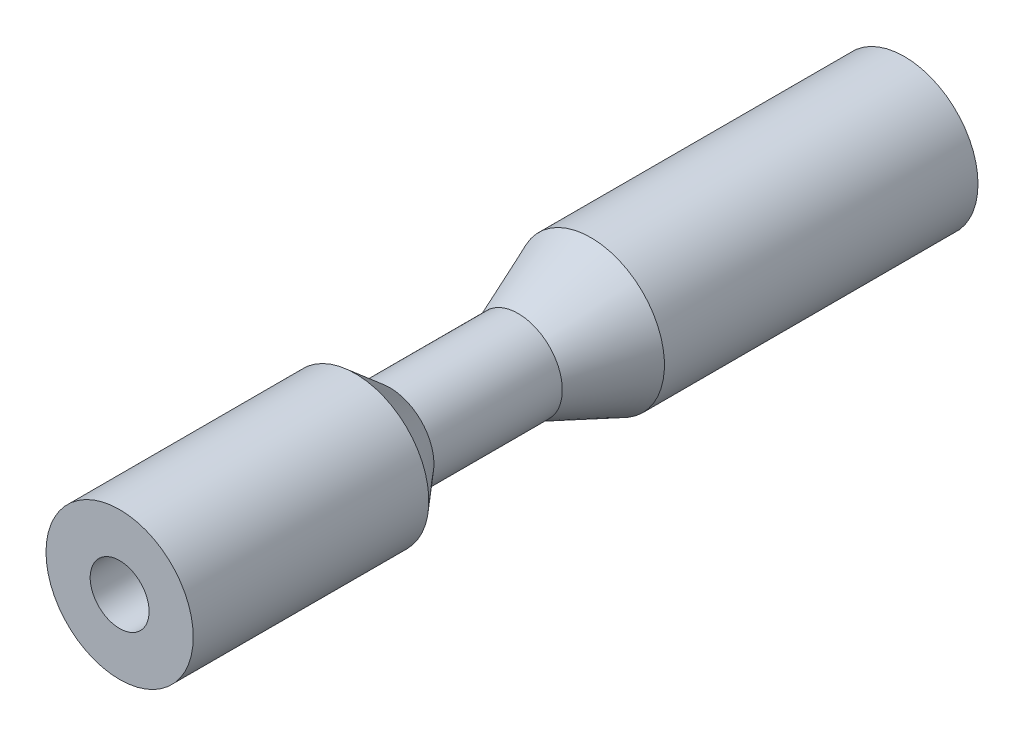
ISO-10303-21;
HEADER;
FILE_DESCRIPTION(('STEP AP214'),'2;1');
FILE_NAME('part.step','',(''),(''),'','','');
FILE_SCHEMA(('AUTOMOTIVE_DESIGN { 1 0 10303 214 1 1 1 1 }'));
ENDSEC;
DATA;
#1=APPLICATION_CONTEXT('core data for automotive mechanical design processes');
#2=APPLICATION_PROTOCOL_DEFINITION('international standard','automotive_design',2000,#1);
#3=PRODUCT_CONTEXT('',#1,'mechanical');
#4=PRODUCT('Part','Part','',(#3));
#5=PRODUCT_RELATED_PRODUCT_CATEGORY('part','',(#4));
#6=PRODUCT_DEFINITION_FORMATION('','',#4);
#7=PRODUCT_DEFINITION_CONTEXT('part definition',#1,'design');
#8=PRODUCT_DEFINITION('design','',#6,#7);
#9=PRODUCT_DEFINITION_SHAPE('','',#8);
#10=(LENGTH_UNIT() NAMED_UNIT(*) SI_UNIT(.MILLI.,.METRE.));
#11=(NAMED_UNIT(*) PLANE_ANGLE_UNIT() SI_UNIT($,.RADIAN.));
#12=(NAMED_UNIT(*) SI_UNIT($,.STERADIAN.) SOLID_ANGLE_UNIT());
#13=UNCERTAINTY_MEASURE_WITH_UNIT(LENGTH_MEASURE(1.E-05),#10,'distance_accuracy_value','');
#14=(GEOMETRIC_REPRESENTATION_CONTEXT(3) GLOBAL_UNCERTAINTY_ASSIGNED_CONTEXT((#13)) GLOBAL_UNIT_ASSIGNED_CONTEXT((#10,
#11,#12)) REPRESENTATION_CONTEXT('',''));
#15=CARTESIAN_POINT('',(0.,0.,0.));
#16=DIRECTION('',(0.,0.,1.));
#17=DIRECTION('',(1.,0.,0.));
#18=AXIS2_PLACEMENT_3D('',#15,#16,#17);
#19=CARTESIAN_POINT('',(0.,0.,27.));
#20=DIRECTION('',(0.,0.,-1.));
#21=DIRECTION('',(-1.,0.,0.));
#22=AXIS2_PLACEMENT_3D('',#19,#20,#21);
#23=CYLINDRICAL_SURFACE('',#22,2.5);
#24=CARTESIAN_POINT('',(0.,0.,27.));
#25=DIRECTION('',(0.,0.,1.));
#26=DIRECTION('',(1.,0.,0.));
#27=AXIS2_PLACEMENT_3D('',#24,#25,#26);
#28=CIRCLE('',#27,2.5);
#29=CARTESIAN_POINT('',(2.5,0.,27.));
#30=VERTEX_POINT('',#29);
#31=EDGE_CURVE('E40',#30,#30,#28,.T.);
#32=ORIENTED_EDGE('',*,*,#31,.F.);
#33=EDGE_LOOP('',(#32));
#34=FACE_BOUND('',#33,.T.);
#35=CARTESIAN_POINT('',(0.,0.,19.));
#36=DIRECTION('',(0.,0.,-1.));
#37=DIRECTION('',(-1.,0.,0.));
#38=AXIS2_PLACEMENT_3D('',#35,#36,#37);
#39=CIRCLE('',#38,2.5);
#40=CARTESIAN_POINT('',(-2.5,0.,19.));
#41=VERTEX_POINT('',#40);
#42=EDGE_CURVE('E44',#41,#41,#39,.T.);
#43=ORIENTED_EDGE('',*,*,#42,.F.);
#44=EDGE_LOOP('',(#43));
#45=FACE_BOUND('',#44,.T.);
#46=ADVANCED_FACE('F29',(#34,#45),#23,.T.);
#47=CARTESIAN_POINT('',(0.,0.,27.));
#48=DIRECTION('',(0.,0.,1.));
#49=DIRECTION('',(1.,0.,0.));
#50=AXIS2_PLACEMENT_3D('',#47,#48,#49);
#51=PLANE('',#50);
#52=CARTESIAN_POINT('',(0.,0.,27.));
#53=DIRECTION('',(0.,0.,1.));
#54=DIRECTION('',(1.,0.,0.));
#55=AXIS2_PLACEMENT_3D('',#52,#53,#54);
#56=CIRCLE('',#55,0.999999999999998);
#57=CARTESIAN_POINT('',(0.999999999999998,0.,27.));
#58=VERTEX_POINT('',#57);
#59=EDGE_CURVE('E61',#58,#58,#56,.T.);
#60=ORIENTED_EDGE('',*,*,#59,.F.);
#61=EDGE_LOOP('',(#60));
#62=FACE_BOUND('',#61,.T.);
#63=ORIENTED_EDGE('',*,*,#31,.T.);
#64=EDGE_LOOP('',(#63));
#65=FACE_BOUND('',#64,.T.);
#66=ADVANCED_FACE('F88',(#62,#65),#51,.T.);
#67=CARTESIAN_POINT('',(0.,0.,17.8276762664459));
#68=DIRECTION('',(0.,0.,1.));
#69=DIRECTION('',(1.,0.,0.));
#70=AXIS2_PLACEMENT_3D('',#67,#68,#69);
#71=CONICAL_SURFACE('',#70,1.5,0.706237021045399);
#72=ORIENTED_EDGE('',*,*,#42,.T.);
#73=EDGE_LOOP('',(#72));
#74=FACE_BOUND('',#73,.T.);
#75=CARTESIAN_POINT('',(0.,0.,17.8276762664459));
#76=DIRECTION('',(0.,0.,-1.));
#77=DIRECTION('',(-1.,0.,0.));
#78=AXIS2_PLACEMENT_3D('',#75,#76,#77);
#79=CIRCLE('',#78,1.5);
#80=CARTESIAN_POINT('',(-1.5,0.,17.8276762664459));
#81=VERTEX_POINT('',#80);
#82=EDGE_CURVE('E49',#81,#81,#79,.T.);
#83=ORIENTED_EDGE('',*,*,#82,.F.);
#84=EDGE_LOOP('',(#83));
#85=FACE_BOUND('',#84,.T.);
#86=ADVANCED_FACE('F93',(#74,#85),#71,.T.);
#87=CARTESIAN_POINT('',(0.,0.,0.));
#88=DIRECTION('',(0.,0.,-1.));
#89=DIRECTION('',(-1.,0.,0.));
#90=AXIS2_PLACEMENT_3D('',#87,#88,#89);
#91=CYLINDRICAL_SURFACE('',#90,1.5);
#92=ORIENTED_EDGE('',*,*,#82,.T.);
#93=EDGE_LOOP('',(#92));
#94=FACE_BOUND('',#93,.T.);
#95=CARTESIAN_POINT('',(0.,0.,13.4678422706706));
#96=DIRECTION('',(0.,0.,-1.));
#97=DIRECTION('',(-1.,0.,0.));
#98=AXIS2_PLACEMENT_3D('',#95,#96,#97);
#99=CIRCLE('',#98,1.5);
#100=CARTESIAN_POINT('',(-1.5,0.,13.4678422706706));
#101=VERTEX_POINT('',#100);
#102=EDGE_CURVE('E52',#101,#101,#99,.T.);
#103=ORIENTED_EDGE('',*,*,#102,.F.);
#104=EDGE_LOOP('',(#103));
#105=FACE_BOUND('',#104,.T.);
#106=ADVANCED_FACE('F83',(#94,#105),#91,.T.);
#107=CARTESIAN_POINT('',(0.,0.,11.));
#108=DIRECTION('',(0.,0.,-1.));
#109=DIRECTION('',(-1.,0.,0.));
#110=AXIS2_PLACEMENT_3D('',#107,#108,#109);
#111=CONICAL_SURFACE('',#110,2.5,0.384991632666817);
#112=ORIENTED_EDGE('',*,*,#102,.T.);
#113=EDGE_LOOP('',(#112));
#114=FACE_BOUND('',#113,.T.);
#115=CARTESIAN_POINT('',(0.,0.,11.));
#116=DIRECTION('',(0.,0.,-1.));
#117=DIRECTION('',(-1.,0.,0.));
#118=AXIS2_PLACEMENT_3D('',#115,#116,#117);
#119=CIRCLE('',#118,2.5);
#120=CARTESIAN_POINT('',(-2.5,0.,11.));
#121=VERTEX_POINT('',#120);
#122=EDGE_CURVE('E55',#121,#121,#119,.T.);
#123=ORIENTED_EDGE('',*,*,#122,.F.);
#124=EDGE_LOOP('',(#123));
#125=FACE_BOUND('',#124,.T.);
#126=ADVANCED_FACE('F77',(#114,#125),#111,.T.);
#127=CARTESIAN_POINT('',(0.,0.,0.));
#128=DIRECTION('',(0.,0.,1.));
#129=DIRECTION('',(1.,0.,0.));
#130=AXIS2_PLACEMENT_3D('',#127,#128,#129);
#131=PLANE('',#130);
#132=CARTESIAN_POINT('',(0.,0.,0.));
#133=DIRECTION('',(0.,0.,-1.));
#134=DIRECTION('',(-1.,0.,0.));
#135=AXIS2_PLACEMENT_3D('',#132,#133,#134);
#136=CIRCLE('',#135,0.25);
#137=CARTESIAN_POINT('',(-0.25,0.,0.));
#138=VERTEX_POINT('',#137);
#139=EDGE_CURVE('E67',#138,#138,#136,.T.);
#140=ORIENTED_EDGE('',*,*,#139,.F.);
#141=EDGE_LOOP('',(#140));
#142=FACE_BOUND('',#141,.T.);
#143=CARTESIAN_POINT('',(0.,0.,0.));
#144=DIRECTION('',(0.,0.,1.));
#145=DIRECTION('',(1.,0.,0.));
#146=AXIS2_PLACEMENT_3D('',#143,#144,#145);
#147=CIRCLE('',#146,0.499999999999963);
#148=CARTESIAN_POINT('',(0.499999999999963,0.,0.));
#149=VERTEX_POINT('',#148);
#150=EDGE_CURVE('E10',#149,#149,#147,.F.);
#151=ORIENTED_EDGE('',*,*,#150,.T.);
#152=EDGE_LOOP('',(#151));
#153=FACE_BOUND('',#152,.T.);
#154=ADVANCED_FACE('F74',(#142,#153),#131,.F.);
#155=CARTESIAN_POINT('',(0.,0.,0.35265396141693));
#156=DIRECTION('',(0.,0.,1.));
#157=DIRECTION('',(1.,0.,0.));
#158=AXIS2_PLACEMENT_3D('',#155,#156,#157);
#159=CIRCLE('',#158,2.5);
#160=CARTESIAN_POINT('',(2.5,0.,0.35265396141693));
#161=VERTEX_POINT('',#160);
#162=EDGE_CURVE('E36',#161,#161,#159,.T.);
#163=ORIENTED_EDGE('',*,*,#162,.T.);
#164=EDGE_LOOP('',(#163));
#165=FACE_BOUND('',#164,.T.);
#166=ORIENTED_EDGE('',*,*,#122,.T.);
#167=EDGE_LOOP('',(#166));
#168=FACE_BOUND('',#167,.T.);
#169=ADVANCED_FACE('F76',(#165,#168),#23,.T.);
#170=CARTESIAN_POINT('',(0.,0.,0.35265396141693));
#171=DIRECTION('',(0.,0.,1.));
#172=DIRECTION('',(1.,0.,0.));
#173=AXIS2_PLACEMENT_3D('',#170,#171,#172);
#174=CONICAL_SURFACE('',#173,2.5,1.39626340159547);
#175=ORIENTED_EDGE('',*,*,#150,.F.);
#176=EDGE_LOOP('',(#175));
#177=FACE_BOUND('',#176,.T.);
#178=ORIENTED_EDGE('',*,*,#162,.F.);
#179=EDGE_LOOP('',(#178));
#180=FACE_BOUND('',#179,.T.);
#181=ADVANCED_FACE('F31',(#177,#180),#174,.T.);
#182=CARTESIAN_POINT('',(0.,0.,1.));
#183=DIRECTION('',(0.,0.,1.));
#184=DIRECTION('',(1.,0.,0.));
#185=AXIS2_PLACEMENT_3D('',#182,#183,#184);
#186=CONICAL_SURFACE('',#185,0.999999999999994,1.02974425867665);
#187=CARTESIAN_POINT('',(0.,0.,0.549354535729329));
#188=DIRECTION('',(0.,0.,1.));
#189=DIRECTION('',(1.,0.,0.));
#190=AXIS2_PLACEMENT_3D('',#187,#188,#189);
#191=CIRCLE('',#190,0.25);
#192=CARTESIAN_POINT('',(0.25,0.,0.549354535729329));
#193=VERTEX_POINT('',#192);
#194=EDGE_CURVE('E64',#193,#193,#191,.T.);
#195=ORIENTED_EDGE('',*,*,#194,.F.);
#196=EDGE_LOOP('',(#195));
#197=FACE_BOUND('',#196,.T.);
#198=CARTESIAN_POINT('',(0.,0.,1.));
#199=DIRECTION('',(0.,0.,1.));
#200=DIRECTION('',(1.,0.,0.));
#201=AXIS2_PLACEMENT_3D('',#198,#199,#200);
#202=CIRCLE('',#201,0.999999999999994);
#203=CARTESIAN_POINT('',(0.999999999999994,0.,1.));
#204=VERTEX_POINT('',#203);
#205=EDGE_CURVE('E58',#204,#204,#202,.T.);
#206=ORIENTED_EDGE('',*,*,#205,.T.);
#207=EDGE_LOOP('',(#206));
#208=FACE_BOUND('',#207,.T.);
#209=ADVANCED_FACE('F114',(#197,#208),#186,.F.);
#210=CARTESIAN_POINT('',(0.,0.,27.));
#211=DIRECTION('',(0.,0.,1.));
#212=DIRECTION('',(1.,0.,0.));
#213=AXIS2_PLACEMENT_3D('',#210,#211,#212);
#214=CYLINDRICAL_SURFACE('',#213,0.999999999999996);
#215=ORIENTED_EDGE('',*,*,#205,.F.);
#216=EDGE_LOOP('',(#215));
#217=FACE_BOUND('',#216,.T.);
#218=ORIENTED_EDGE('',*,*,#59,.T.);
#219=EDGE_LOOP('',(#218));
#220=FACE_BOUND('',#219,.T.);
#221=ADVANCED_FACE('F117',(#217,#220),#214,.F.);
#222=CARTESIAN_POINT('',(0.,0.,27.001));
#223=DIRECTION('',(0.,0.,-1.));
#224=DIRECTION('',(-1.,0.,0.));
#225=AXIS2_PLACEMENT_3D('',#222,#223,#224);
#226=CYLINDRICAL_SURFACE('',#225,0.25);
#227=ORIENTED_EDGE('',*,*,#139,.T.);
#228=EDGE_LOOP('',(#227));
#229=FACE_BOUND('',#228,.T.);
#230=ORIENTED_EDGE('',*,*,#194,.T.);
#231=EDGE_LOOP('',(#230));
#232=FACE_BOUND('',#231,.T.);
#233=ADVANCED_FACE('F71',(#229,#232),#226,.F.);
#234=CLOSED_SHELL('',(#46,#66,#86,#106,#126,#154,#169,#181,#209,#221,#233));
#235=MANIFOLD_SOLID_BREP('B2',#234);
#236=ADVANCED_BREP_SHAPE_REPRESENTATION('',(#18,#235),#14);
#237=SHAPE_DEFINITION_REPRESENTATION(#9,#236);
ENDSEC;
END-ISO-10303-21;
